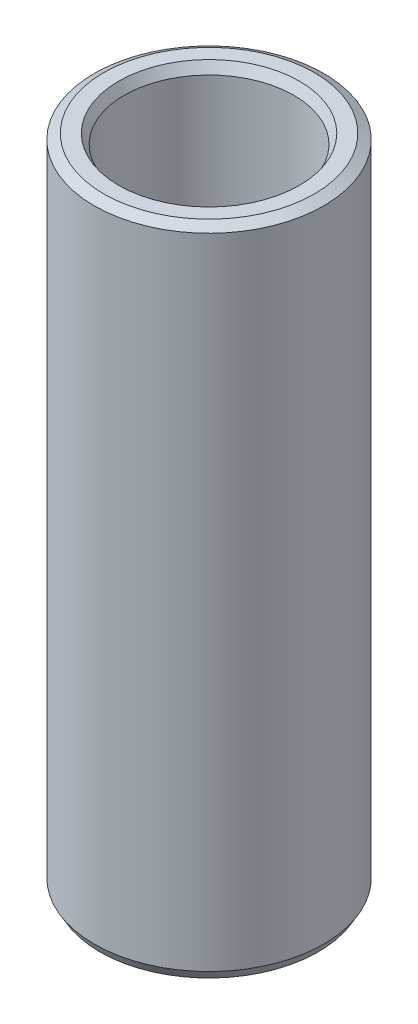
ISO-10303-21;
HEADER;
FILE_DESCRIPTION(('STEP AP214'),'2;1');
FILE_NAME('part.step','',(''),(''),'','','');
FILE_SCHEMA(('AUTOMOTIVE_DESIGN { 1 0 10303 214 1 1 1 1 }'));
ENDSEC;
DATA;
#1=APPLICATION_CONTEXT('core data for automotive mechanical design processes');
#2=APPLICATION_PROTOCOL_DEFINITION('international standard','automotive_design',2000,#1);
#3=PRODUCT_CONTEXT('',#1,'mechanical');
#4=PRODUCT('Part','Part','',(#3));
#5=PRODUCT_RELATED_PRODUCT_CATEGORY('part','',(#4));
#6=PRODUCT_DEFINITION_FORMATION('','',#4);
#7=PRODUCT_DEFINITION_CONTEXT('part definition',#1,'design');
#8=PRODUCT_DEFINITION('design','',#6,#7);
#9=PRODUCT_DEFINITION_SHAPE('','',#8);
#10=(LENGTH_UNIT() NAMED_UNIT(*) SI_UNIT(.MILLI.,.METRE.));
#11=(NAMED_UNIT(*) PLANE_ANGLE_UNIT() SI_UNIT($,.RADIAN.));
#12=(NAMED_UNIT(*) SI_UNIT($,.STERADIAN.) SOLID_ANGLE_UNIT());
#13=UNCERTAINTY_MEASURE_WITH_UNIT(LENGTH_MEASURE(1.E-05),#10,'distance_accuracy_value','');
#14=(GEOMETRIC_REPRESENTATION_CONTEXT(3) GLOBAL_UNCERTAINTY_ASSIGNED_CONTEXT((#13)) GLOBAL_UNIT_ASSIGNED_CONTEXT((#10,
#11,#12)) REPRESENTATION_CONTEXT('',''));
#15=CARTESIAN_POINT('',(0.,0.,0.));
#16=DIRECTION('',(0.,0.,1.));
#17=DIRECTION('',(1.,0.,0.));
#18=AXIS2_PLACEMENT_3D('',#15,#16,#17);
#19=CARTESIAN_POINT('',(0.,285.169158643486,0.));
#20=DIRECTION('',(0.,-1.,0.));
#21=DIRECTION('',(0.,0.,-1.));
#22=AXIS2_PLACEMENT_3D('',#19,#20,#21);
#23=CYLINDRICAL_SURFACE('',#22,50.);
#24=CARTESIAN_POINT('',(0.,4.14522149251084,0.));
#25=DIRECTION('',(0.,1.,0.));
#26=DIRECTION('',(0.,0.,1.));
#27=AXIS2_PLACEMENT_3D('',#24,#25,#26);
#28=CIRCLE('',#27,50.);
#29=CARTESIAN_POINT('',(0.,4.14522149251084,50.));
#30=VERTEX_POINT('',#29);
#31=EDGE_CURVE('E10',#30,#30,#28,.T.);
#32=ORIENTED_EDGE('',*,*,#31,.T.);
#33=EDGE_LOOP('',(#32));
#34=FACE_BOUND('',#33,.T.);
#35=CARTESIAN_POINT('',(0.,282.775913898935,0.));
#36=DIRECTION('',(0.,1.,0.));
#37=DIRECTION('',(0.,0.,1.));
#38=AXIS2_PLACEMENT_3D('',#35,#36,#37);
#39=CIRCLE('',#38,50.);
#40=CARTESIAN_POINT('',(0.,282.775913898935,50.));
#41=VERTEX_POINT('',#40);
#42=EDGE_CURVE('E50',#41,#41,#39,.F.);
#43=ORIENTED_EDGE('',*,*,#42,.T.);
#44=EDGE_LOOP('',(#43));
#45=FACE_BOUND('',#44,.T.);
#46=ADVANCED_FACE('F39',(#34,#45),#23,.T.);
#47=CARTESIAN_POINT('',(0.,285.169158643486,0.));
#48=DIRECTION('',(0.,1.,0.));
#49=DIRECTION('',(0.,0.,1.));
#50=AXIS2_PLACEMENT_3D('',#47,#48,#49);
#51=PLANE('',#50);
#52=CARTESIAN_POINT('',(0.,285.169158643486,0.));
#53=DIRECTION('',(0.,1.,0.));
#54=DIRECTION('',(0.,0.,1.));
#55=AXIS2_PLACEMENT_3D('',#52,#53,#54);
#56=CIRCLE('',#55,39.3671535477392);
#57=CARTESIAN_POINT('',(0.,285.169158643486,39.3671535477392));
#58=VERTEX_POINT('',#57);
#59=EDGE_CURVE('E58',#58,#58,#56,.F.);
#60=ORIENTED_EDGE('',*,*,#59,.T.);
#61=EDGE_LOOP('',(#60));
#62=FACE_BOUND('',#61,.T.);
#63=CARTESIAN_POINT('',(0.,285.169158643486,0.));
#64=DIRECTION('',(0.,1.,0.));
#65=DIRECTION('',(0.,0.,1.));
#66=AXIS2_PLACEMENT_3D('',#63,#64,#65);
#67=CIRCLE('',#66,45.8547785074893);
#68=CARTESIAN_POINT('',(0.,285.169158643486,45.8547785074893));
#69=VERTEX_POINT('',#68);
#70=EDGE_CURVE('E61',#69,#69,#67,.T.);
#71=ORIENTED_EDGE('',*,*,#70,.T.);
#72=EDGE_LOOP('',(#71));
#73=FACE_BOUND('',#72,.T.);
#74=ADVANCED_FACE('F88',(#62,#73),#51,.T.);
#75=CARTESIAN_POINT('',(0.,0.,0.));
#76=DIRECTION('',(0.,1.,0.));
#77=DIRECTION('',(0.,0.,1.));
#78=AXIS2_PLACEMENT_3D('',#75,#76,#77);
#79=PLANE('',#78);
#80=CARTESIAN_POINT('',(0.,0.,0.));
#81=DIRECTION('',(0.,1.,0.));
#82=DIRECTION('',(0.,0.,1.));
#83=AXIS2_PLACEMENT_3D('',#80,#81,#82);
#84=CIRCLE('',#83,41.1191302956982);
#85=CARTESIAN_POINT('',(0.,0.,41.1191302956982));
#86=VERTEX_POINT('',#85);
#87=EDGE_CURVE('E51',#86,#86,#84,.T.);
#88=ORIENTED_EDGE('',*,*,#87,.T.);
#89=EDGE_LOOP('',(#88));
#90=FACE_BOUND('',#89,.T.);
#91=CARTESIAN_POINT('',(0.,0.,0.));
#92=DIRECTION('',(0.,1.,0.));
#93=DIRECTION('',(0.,0.,1.));
#94=AXIS2_PLACEMENT_3D('',#91,#92,#93);
#95=CIRCLE('',#94,47.6067552554482);
#96=CARTESIAN_POINT('',(0.,0.,47.6067552554482));
#97=VERTEX_POINT('',#96);
#98=EDGE_CURVE('E54',#97,#97,#95,.F.);
#99=ORIENTED_EDGE('',*,*,#98,.T.);
#100=EDGE_LOOP('',(#99));
#101=FACE_BOUND('',#100,.T.);
#102=ADVANCED_FACE('F83',(#90,#101),#79,.F.);
#103=CARTESIAN_POINT('',(0.,285.169158643486,0.));
#104=DIRECTION('',(0.,-1.,0.));
#105=DIRECTION('',(0.,0.,-1.));
#106=AXIS2_PLACEMENT_3D('',#103,#104,#105);
#107=CYLINDRICAL_SURFACE('',#106,36.9739088031874);
#108=CARTESIAN_POINT('',(0.,281.023937150975,0.));
#109=DIRECTION('',(0.,1.,0.));
#110=DIRECTION('',(0.,0.,1.));
#111=AXIS2_PLACEMENT_3D('',#108,#109,#110);
#112=CIRCLE('',#111,36.9739088031874);
#113=CARTESIAN_POINT('',(0.,281.023937150975,36.9739088031874));
#114=VERTEX_POINT('',#113);
#115=EDGE_CURVE('E67',#114,#114,#112,.T.);
#116=ORIENTED_EDGE('',*,*,#115,.T.);
#117=EDGE_LOOP('',(#116));
#118=FACE_BOUND('',#117,.T.);
#119=CARTESIAN_POINT('',(0.,2.39324474455177,0.));
#120=DIRECTION('',(0.,1.,0.));
#121=DIRECTION('',(0.,0.,1.));
#122=AXIS2_PLACEMENT_3D('',#119,#120,#121);
#123=CIRCLE('',#122,36.9739088031874);
#124=CARTESIAN_POINT('',(0.,2.39324474455177,36.9739088031874));
#125=VERTEX_POINT('',#124);
#126=EDGE_CURVE('E69',#125,#125,#123,.F.);
#127=ORIENTED_EDGE('',*,*,#126,.T.);
#128=EDGE_LOOP('',(#127));
#129=FACE_BOUND('',#128,.T.);
#130=ADVANCED_FACE('F71',(#118,#129),#107,.F.);
#131=CARTESIAN_POINT('',(0.,281.023937150975,0.));
#132=DIRECTION('',(0.,1.,0.));
#133=DIRECTION('',(0.,0.,1.));
#134=AXIS2_PLACEMENT_3D('',#131,#132,#133);
#135=CONICAL_SURFACE('',#134,36.9739088031874,0.523598775598304);
#136=ORIENTED_EDGE('',*,*,#59,.F.);
#137=EDGE_LOOP('',(#136));
#138=FACE_BOUND('',#137,.T.);
#139=ORIENTED_EDGE('',*,*,#115,.F.);
#140=EDGE_LOOP('',(#139));
#141=FACE_BOUND('',#140,.T.);
#142=ADVANCED_FACE('F77',(#138,#141),#135,.F.);
#143=CARTESIAN_POINT('',(0.,0.,0.));
#144=DIRECTION('',(0.,-1.,0.));
#145=DIRECTION('',(0.,0.,-1.));
#146=AXIS2_PLACEMENT_3D('',#143,#144,#145);
#147=CONICAL_SURFACE('',#146,41.1191302956982,1.04719755119659);
#148=ORIENTED_EDGE('',*,*,#126,.F.);
#149=EDGE_LOOP('',(#148));
#150=FACE_BOUND('',#149,.T.);
#151=ORIENTED_EDGE('',*,*,#87,.F.);
#152=EDGE_LOOP('',(#151));
#153=FACE_BOUND('',#152,.T.);
#154=ADVANCED_FACE('F73',(#150,#153),#147,.F.);
#155=CARTESIAN_POINT('',(0.,4.14522149251084,0.));
#156=DIRECTION('',(0.,1.,0.));
#157=DIRECTION('',(0.,0.,1.));
#158=AXIS2_PLACEMENT_3D('',#155,#156,#157);
#159=CONICAL_SURFACE('',#158,50.,0.523598775598304);
#160=ORIENTED_EDGE('',*,*,#98,.F.);
#161=EDGE_LOOP('',(#160));
#162=FACE_BOUND('',#161,.T.);
#163=ORIENTED_EDGE('',*,*,#31,.F.);
#164=EDGE_LOOP('',(#163));
#165=FACE_BOUND('',#164,.T.);
#166=ADVANCED_FACE('F76',(#162,#165),#159,.T.);
#167=CARTESIAN_POINT('',(0.,285.169158643486,0.));
#168=DIRECTION('',(0.,-1.,0.));
#169=DIRECTION('',(0.,0.,-1.));
#170=AXIS2_PLACEMENT_3D('',#167,#168,#169);
#171=CONICAL_SURFACE('',#170,45.8547785074893,1.0471975511966);
#172=ORIENTED_EDGE('',*,*,#42,.F.);
#173=EDGE_LOOP('',(#172));
#174=FACE_BOUND('',#173,.T.);
#175=ORIENTED_EDGE('',*,*,#70,.F.);
#176=EDGE_LOOP('',(#175));
#177=FACE_BOUND('',#176,.T.);
#178=ADVANCED_FACE('F45',(#174,#177),#171,.T.);
#179=CLOSED_SHELL('',(#46,#74,#102,#130,#142,#154,#166,#178));
#180=MANIFOLD_SOLID_BREP('B2',#179);
#181=ADVANCED_BREP_SHAPE_REPRESENTATION('',(#18,#180),#14);
#182=SHAPE_DEFINITION_REPRESENTATION(#9,#181);
ENDSEC;
END-ISO-10303-21;
